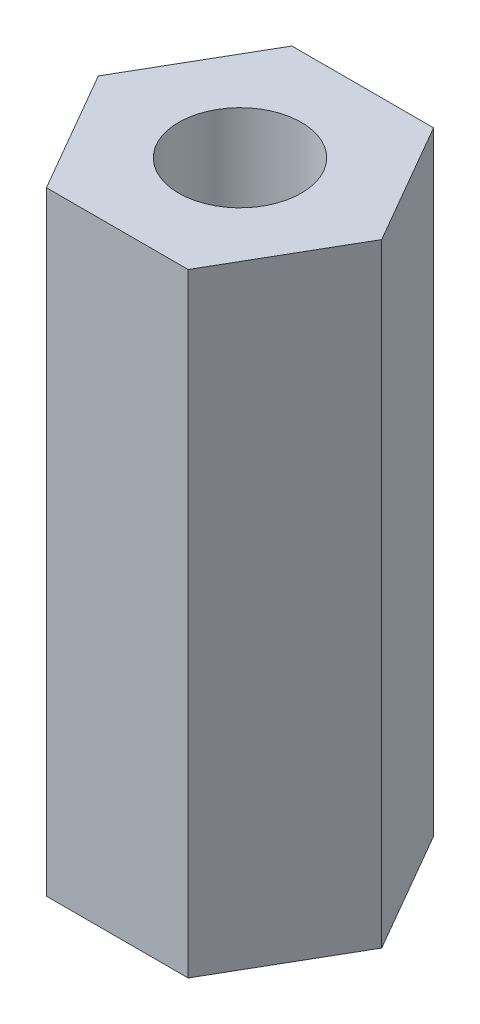
ISO-10303-21;
HEADER;
FILE_DESCRIPTION(('STEP AP214'),'2;1');
FILE_NAME('part.step','',(''),(''),'','','');
FILE_SCHEMA(('AUTOMOTIVE_DESIGN { 1 0 10303 214 1 1 1 1 }'));
ENDSEC;
DATA;
#1=APPLICATION_CONTEXT('core data for automotive mechanical design processes');
#2=APPLICATION_PROTOCOL_DEFINITION('international standard','automotive_design',2000,#1);
#3=PRODUCT_CONTEXT('',#1,'mechanical');
#4=PRODUCT('Part','Part','',(#3));
#5=PRODUCT_RELATED_PRODUCT_CATEGORY('part','',(#4));
#6=PRODUCT_DEFINITION_FORMATION('','',#4);
#7=PRODUCT_DEFINITION_CONTEXT('part definition',#1,'design');
#8=PRODUCT_DEFINITION('design','',#6,#7);
#9=PRODUCT_DEFINITION_SHAPE('','',#8);
#10=(LENGTH_UNIT() NAMED_UNIT(*) SI_UNIT(.MILLI.,.METRE.));
#11=(NAMED_UNIT(*) PLANE_ANGLE_UNIT() SI_UNIT($,.RADIAN.));
#12=(NAMED_UNIT(*) SI_UNIT($,.STERADIAN.) SOLID_ANGLE_UNIT());
#13=UNCERTAINTY_MEASURE_WITH_UNIT(LENGTH_MEASURE(1.E-05),#10,'distance_accuracy_value','');
#14=(GEOMETRIC_REPRESENTATION_CONTEXT(3) GLOBAL_UNCERTAINTY_ASSIGNED_CONTEXT((#13)) GLOBAL_UNIT_ASSIGNED_CONTEXT((#10,
#11,#12)) REPRESENTATION_CONTEXT('',''));
#15=CARTESIAN_POINT('',(0.,0.,0.));
#16=DIRECTION('',(0.,0.,1.));
#17=DIRECTION('',(1.,0.,0.));
#18=AXIS2_PLACEMENT_3D('',#15,#16,#17);
#19=CARTESIAN_POINT('',(0.,15.,0.));
#20=DIRECTION('',(0.,1.,0.));
#21=DIRECTION('',(0.,0.,1.));
#22=AXIS2_PLACEMENT_3D('',#19,#20,#21);
#23=PLANE('',#22);
#24=DIRECTION('',(0.499999999999999,0.,-0.866025403784439));
#25=VECTOR('',#24,1.);
#26=CARTESIAN_POINT('',(1.73205080756888,15.,3.));
#27=LINE('',#26,#25);
#28=CARTESIAN_POINT('',(1.73205080756888,15.,3.));
#29=VERTEX_POINT('',#28);
#30=CARTESIAN_POINT('',(3.46410161513775,15.,0.));
#31=VERTEX_POINT('',#30);
#32=EDGE_CURVE('E131',#29,#31,#27,.T.);
#33=ORIENTED_EDGE('',*,*,#32,.T.);
#34=DIRECTION('',(-0.5,0.,-0.866025403784439));
#35=VECTOR('',#34,1.);
#36=CARTESIAN_POINT('',(3.46410161513775,15.,0.));
#37=LINE('',#36,#35);
#38=CARTESIAN_POINT('',(1.73205080756888,15.,-3.));
#39=VERTEX_POINT('',#38);
#40=EDGE_CURVE('E89',#31,#39,#37,.T.);
#41=ORIENTED_EDGE('',*,*,#40,.T.);
#42=DIRECTION('',(-1.,0.,0.));
#43=VECTOR('',#42,1.);
#44=CARTESIAN_POINT('',(1.73205080756888,15.,-3.));
#45=LINE('',#44,#43);
#46=CARTESIAN_POINT('',(-1.73205080756888,15.,-3.));
#47=VERTEX_POINT('',#46);
#48=EDGE_CURVE('E102',#39,#47,#45,.T.);
#49=ORIENTED_EDGE('',*,*,#48,.T.);
#50=DIRECTION('',(-0.5,0.,0.866025403784439));
#51=VECTOR('',#50,1.);
#52=CARTESIAN_POINT('',(-1.73205080756888,15.,-3.));
#53=LINE('',#52,#51);
#54=CARTESIAN_POINT('',(-3.46410161513775,15.,0.));
#55=VERTEX_POINT('',#54);
#56=EDGE_CURVE('E96',#47,#55,#53,.T.);
#57=ORIENTED_EDGE('',*,*,#56,.T.);
#58=DIRECTION('',(0.5,0.,0.866025403784439));
#59=VECTOR('',#58,1.);
#60=CARTESIAN_POINT('',(-3.46410161513775,15.,0.));
#61=LINE('',#60,#59);
#62=CARTESIAN_POINT('',(-1.73205080756888,15.,3.));
#63=VERTEX_POINT('',#62);
#64=EDGE_CURVE('E100',#55,#63,#61,.T.);
#65=ORIENTED_EDGE('',*,*,#64,.T.);
#66=DIRECTION('',(1.,0.,0.));
#67=VECTOR('',#66,1.);
#68=CARTESIAN_POINT('',(-1.73205080756888,15.,3.));
#69=LINE('',#68,#67);
#70=EDGE_CURVE('E52',#63,#29,#69,.T.);
#71=ORIENTED_EDGE('',*,*,#70,.T.);
#72=EDGE_LOOP('',(#33,#41,#49,#57,#65,#71));
#73=FACE_BOUND('',#72,.T.);
#74=CARTESIAN_POINT('',(0.,15.,0.));
#75=DIRECTION('',(0.,1.,0.));
#76=DIRECTION('',(0.,0.,1.));
#77=AXIS2_PLACEMENT_3D('',#74,#75,#76);
#78=CIRCLE('',#77,1.5);
#79=CARTESIAN_POINT('',(0.,15.,1.5));
#80=VERTEX_POINT('',#79);
#81=EDGE_CURVE('E124',#80,#80,#78,.T.);
#82=ORIENTED_EDGE('',*,*,#81,.F.);
#83=EDGE_LOOP('',(#82));
#84=FACE_BOUND('',#83,.T.);
#85=ADVANCED_FACE('F35',(#73,#84),#23,.T.);
#86=CARTESIAN_POINT('',(0.,0.,0.));
#87=DIRECTION('',(0.,1.,0.));
#88=DIRECTION('',(0.,0.,1.));
#89=AXIS2_PLACEMENT_3D('',#86,#87,#88);
#90=PLANE('',#89);
#91=DIRECTION('',(0.499999999999999,0.,-0.866025403784439));
#92=VECTOR('',#91,1.);
#93=CARTESIAN_POINT('',(1.73205080756888,0.,3.));
#94=LINE('',#93,#92);
#95=CARTESIAN_POINT('',(1.73205080756888,0.,3.));
#96=VERTEX_POINT('',#95);
#97=CARTESIAN_POINT('',(3.46410161513775,0.,0.));
#98=VERTEX_POINT('',#97);
#99=EDGE_CURVE('E120',#96,#98,#94,.T.);
#100=ORIENTED_EDGE('',*,*,#99,.F.);
#101=DIRECTION('',(1.,0.,0.));
#102=VECTOR('',#101,1.);
#103=CARTESIAN_POINT('',(-1.73205080756888,0.,3.));
#104=LINE('',#103,#102);
#105=CARTESIAN_POINT('',(-1.73205080756888,0.,3.));
#106=VERTEX_POINT('',#105);
#107=EDGE_CURVE('E81',#106,#96,#104,.T.);
#108=ORIENTED_EDGE('',*,*,#107,.F.);
#109=DIRECTION('',(0.5,0.,0.866025403784439));
#110=VECTOR('',#109,1.);
#111=CARTESIAN_POINT('',(-3.46410161513775,0.,0.));
#112=LINE('',#111,#110);
#113=CARTESIAN_POINT('',(-3.46410161513775,0.,0.));
#114=VERTEX_POINT('',#113);
#115=EDGE_CURVE('E75',#114,#106,#112,.T.);
#116=ORIENTED_EDGE('',*,*,#115,.F.);
#117=DIRECTION('',(-0.5,0.,0.866025403784439));
#118=VECTOR('',#117,1.);
#119=CARTESIAN_POINT('',(-1.73205080756888,0.,-3.));
#120=LINE('',#119,#118);
#121=CARTESIAN_POINT('',(-1.73205080756888,0.,-3.));
#122=VERTEX_POINT('',#121);
#123=EDGE_CURVE('E110',#122,#114,#120,.T.);
#124=ORIENTED_EDGE('',*,*,#123,.F.);
#125=DIRECTION('',(-1.,0.,0.));
#126=VECTOR('',#125,1.);
#127=CARTESIAN_POINT('',(1.73205080756888,0.,-3.));
#128=LINE('',#127,#126);
#129=CARTESIAN_POINT('',(1.73205080756888,0.,-3.));
#130=VERTEX_POINT('',#129);
#131=EDGE_CURVE('E126',#130,#122,#128,.T.);
#132=ORIENTED_EDGE('',*,*,#131,.F.);
#133=DIRECTION('',(-0.5,0.,-0.866025403784439));
#134=VECTOR('',#133,1.);
#135=CARTESIAN_POINT('',(3.46410161513775,0.,0.));
#136=LINE('',#135,#134);
#137=EDGE_CURVE('E123',#98,#130,#136,.T.);
#138=ORIENTED_EDGE('',*,*,#137,.F.);
#139=EDGE_LOOP('',(#100,#108,#116,#124,#132,#138));
#140=FACE_BOUND('',#139,.T.);
#141=CARTESIAN_POINT('',(0.,0.,0.));
#142=DIRECTION('',(0.,1.,0.));
#143=DIRECTION('',(0.,0.,1.));
#144=AXIS2_PLACEMENT_3D('',#141,#142,#143);
#145=CIRCLE('',#144,1.5);
#146=CARTESIAN_POINT('',(0.,0.,1.5));
#147=VERTEX_POINT('',#146);
#148=EDGE_CURVE('E224',#147,#147,#145,.T.);
#149=ORIENTED_EDGE('',*,*,#148,.T.);
#150=EDGE_LOOP('',(#149));
#151=FACE_BOUND('',#150,.T.);
#152=ADVANCED_FACE('F140',(#140,#151),#90,.F.);
#153=CARTESIAN_POINT('',(1.73205080756888,15.,3.));
#154=DIRECTION('',(-0.866025403784439,0.,-0.499999999999999));
#155=DIRECTION('',(-0.5,0.,0.866025403784439));
#156=AXIS2_PLACEMENT_3D('',#153,#154,#155);
#157=PLANE('',#156);
#158=ORIENTED_EDGE('',*,*,#99,.T.);
#159=DIRECTION('',(0.,-1.,0.));
#160=VECTOR('',#159,1.);
#161=CARTESIAN_POINT('',(3.46410161513775,15.,0.));
#162=LINE('',#161,#160);
#163=EDGE_CURVE('E11',#31,#98,#162,.T.);
#164=ORIENTED_EDGE('',*,*,#163,.F.);
#165=ORIENTED_EDGE('',*,*,#32,.F.);
#166=DIRECTION('',(0.,-1.,0.));
#167=VECTOR('',#166,1.);
#168=CARTESIAN_POINT('',(1.73205080756888,15.,3.));
#169=LINE('',#168,#167);
#170=EDGE_CURVE('E116',#29,#96,#169,.T.);
#171=ORIENTED_EDGE('',*,*,#170,.T.);
#172=EDGE_LOOP('',(#158,#164,#165,#171));
#173=FACE_BOUND('',#172,.T.);
#174=ADVANCED_FACE('F37',(#173),#157,.F.);
#175=CARTESIAN_POINT('',(3.46410161513775,15.,0.));
#176=DIRECTION('',(-0.866025403784439,0.,0.5));
#177=DIRECTION('',(0.5,0.,0.866025403784439));
#178=AXIS2_PLACEMENT_3D('',#175,#176,#177);
#179=PLANE('',#178);
#180=ORIENTED_EDGE('',*,*,#137,.T.);
#181=DIRECTION('',(0.,-1.,0.));
#182=VECTOR('',#181,1.);
#183=CARTESIAN_POINT('',(1.73205080756888,15.,-3.));
#184=LINE('',#183,#182);
#185=EDGE_CURVE('E44',#39,#130,#184,.T.);
#186=ORIENTED_EDGE('',*,*,#185,.F.);
#187=ORIENTED_EDGE('',*,*,#40,.F.);
#188=ORIENTED_EDGE('',*,*,#163,.T.);
#189=EDGE_LOOP('',(#180,#186,#187,#188));
#190=FACE_BOUND('',#189,.T.);
#191=ADVANCED_FACE('F165',(#190),#179,.F.);
#192=CARTESIAN_POINT('',(1.73205080756888,15.,-3.));
#193=DIRECTION('',(0.,0.,1.));
#194=DIRECTION('',(1.,0.,0.));
#195=AXIS2_PLACEMENT_3D('',#192,#193,#194);
#196=PLANE('',#195);
#197=ORIENTED_EDGE('',*,*,#131,.T.);
#198=DIRECTION('',(0.,-1.,0.));
#199=VECTOR('',#198,1.);
#200=CARTESIAN_POINT('',(-1.73205080756888,15.,-3.));
#201=LINE('',#200,#199);
#202=EDGE_CURVE('E111',#47,#122,#201,.T.);
#203=ORIENTED_EDGE('',*,*,#202,.F.);
#204=ORIENTED_EDGE('',*,*,#48,.F.);
#205=ORIENTED_EDGE('',*,*,#185,.T.);
#206=EDGE_LOOP('',(#197,#203,#204,#205));
#207=FACE_BOUND('',#206,.T.);
#208=ADVANCED_FACE('F137',(#207),#196,.F.);
#209=CARTESIAN_POINT('',(-1.73205080756888,15.,-3.));
#210=DIRECTION('',(0.866025403784439,0.,0.5));
#211=DIRECTION('',(0.5,0.,-0.866025403784439));
#212=AXIS2_PLACEMENT_3D('',#209,#210,#211);
#213=PLANE('',#212);
#214=ORIENTED_EDGE('',*,*,#123,.T.);
#215=DIRECTION('',(0.,-1.,0.));
#216=VECTOR('',#215,1.);
#217=CARTESIAN_POINT('',(-3.46410161513775,15.,0.));
#218=LINE('',#217,#216);
#219=EDGE_CURVE('E107',#55,#114,#218,.T.);
#220=ORIENTED_EDGE('',*,*,#219,.F.);
#221=ORIENTED_EDGE('',*,*,#56,.F.);
#222=ORIENTED_EDGE('',*,*,#202,.T.);
#223=EDGE_LOOP('',(#214,#220,#221,#222));
#224=FACE_BOUND('',#223,.T.);
#225=ADVANCED_FACE('F108',(#224),#213,.F.);
#226=CARTESIAN_POINT('',(-3.46410161513775,15.,0.));
#227=DIRECTION('',(0.866025403784439,0.,-0.5));
#228=DIRECTION('',(-0.5,0.,-0.866025403784439));
#229=AXIS2_PLACEMENT_3D('',#226,#227,#228);
#230=PLANE('',#229);
#231=ORIENTED_EDGE('',*,*,#115,.T.);
#232=DIRECTION('',(0.,-1.,0.));
#233=VECTOR('',#232,1.);
#234=CARTESIAN_POINT('',(-1.73205080756888,15.,3.));
#235=LINE('',#234,#233);
#236=EDGE_CURVE('E112',#63,#106,#235,.T.);
#237=ORIENTED_EDGE('',*,*,#236,.F.);
#238=ORIENTED_EDGE('',*,*,#64,.F.);
#239=ORIENTED_EDGE('',*,*,#219,.T.);
#240=EDGE_LOOP('',(#231,#237,#238,#239));
#241=FACE_BOUND('',#240,.T.);
#242=ADVANCED_FACE('F114',(#241),#230,.F.);
#243=CARTESIAN_POINT('',(-1.73205080756888,15.,3.));
#244=DIRECTION('',(0.,0.,-1.));
#245=DIRECTION('',(-1.,0.,0.));
#246=AXIS2_PLACEMENT_3D('',#243,#244,#245);
#247=PLANE('',#246);
#248=ORIENTED_EDGE('',*,*,#107,.T.);
#249=ORIENTED_EDGE('',*,*,#170,.F.);
#250=ORIENTED_EDGE('',*,*,#70,.F.);
#251=ORIENTED_EDGE('',*,*,#236,.T.);
#252=EDGE_LOOP('',(#248,#249,#250,#251));
#253=FACE_BOUND('',#252,.T.);
#254=ADVANCED_FACE('F145',(#253),#247,.F.);
#255=CARTESIAN_POINT('',(0.,15.,0.));
#256=DIRECTION('',(0.,-1.,0.));
#257=DIRECTION('',(0.,0.,-1.));
#258=AXIS2_PLACEMENT_3D('',#255,#256,#257);
#259=CYLINDRICAL_SURFACE('',#258,1.5);
#260=ORIENTED_EDGE('',*,*,#81,.T.);
#261=EDGE_LOOP('',(#260));
#262=FACE_BOUND('',#261,.T.);
#263=ORIENTED_EDGE('',*,*,#148,.F.);
#264=EDGE_LOOP('',(#263));
#265=FACE_BOUND('',#264,.T.);
#266=ADVANCED_FACE('F147',(#262,#265),#259,.F.);
#267=CLOSED_SHELL('',(#85,#152,#174,#191,#208,#225,#242,#254,#266));
#268=MANIFOLD_SOLID_BREP('B2',#267);
#269=ADVANCED_BREP_SHAPE_REPRESENTATION('',(#18,#268),#14);
#270=SHAPE_DEFINITION_REPRESENTATION(#9,#269);
ENDSEC;
END-ISO-10303-21;
